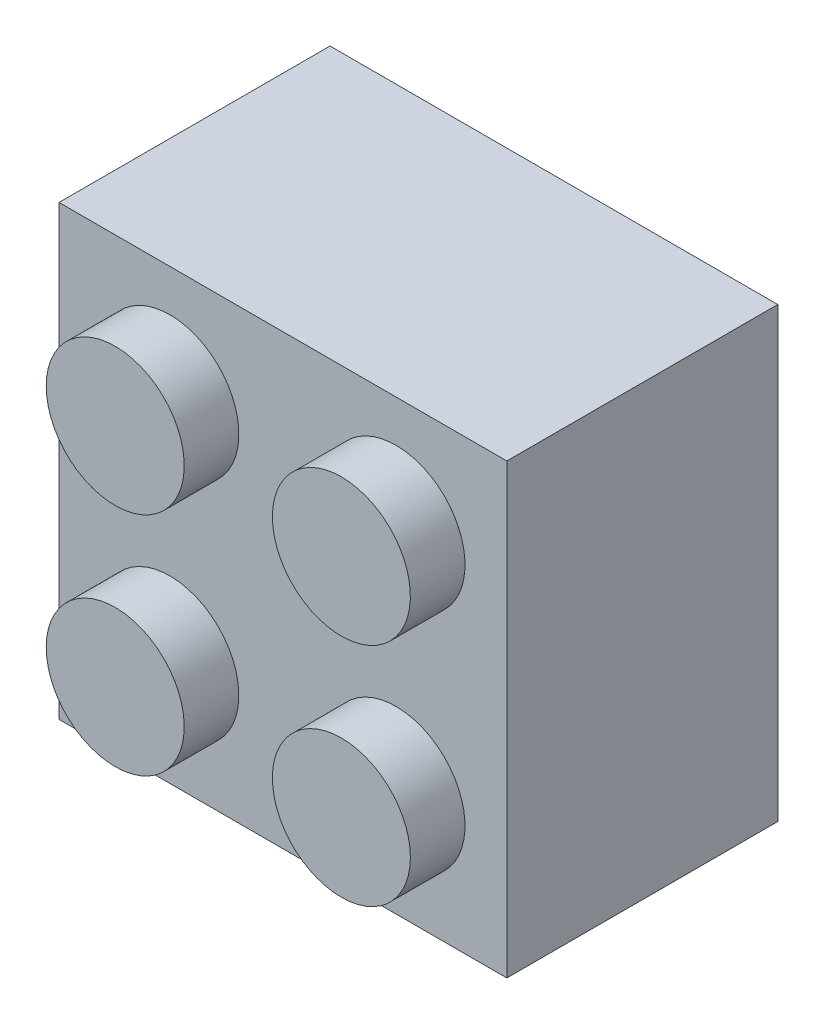
ISO-10303-21;
HEADER;
FILE_DESCRIPTION(('STEP AP214'),'2;1');
FILE_NAME('part.step','',(''),(''),'','','');
FILE_SCHEMA(('AUTOMOTIVE_DESIGN { 1 0 10303 214 1 1 1 1 }'));
ENDSEC;
DATA;
#1=APPLICATION_CONTEXT('core data for automotive mechanical design processes');
#2=APPLICATION_PROTOCOL_DEFINITION('international standard','automotive_design',2000,#1);
#3=PRODUCT_CONTEXT('',#1,'mechanical');
#4=PRODUCT('Part','Part','',(#3));
#5=PRODUCT_RELATED_PRODUCT_CATEGORY('part','',(#4));
#6=PRODUCT_DEFINITION_FORMATION('','',#4);
#7=PRODUCT_DEFINITION_CONTEXT('part definition',#1,'design');
#8=PRODUCT_DEFINITION('design','',#6,#7);
#9=PRODUCT_DEFINITION_SHAPE('','',#8);
#10=(LENGTH_UNIT() NAMED_UNIT(*) SI_UNIT(.MILLI.,.METRE.));
#11=(NAMED_UNIT(*) PLANE_ANGLE_UNIT() SI_UNIT($,.RADIAN.));
#12=(NAMED_UNIT(*) SI_UNIT($,.STERADIAN.) SOLID_ANGLE_UNIT());
#13=UNCERTAINTY_MEASURE_WITH_UNIT(LENGTH_MEASURE(1.E-05),#10,'distance_accuracy_value','');
#14=(GEOMETRIC_REPRESENTATION_CONTEXT(3) GLOBAL_UNCERTAINTY_ASSIGNED_CONTEXT((#13)) GLOBAL_UNIT_ASSIGNED_CONTEXT((#10,
#11,#12)) REPRESENTATION_CONTEXT('',''));
#15=CARTESIAN_POINT('',(0.,0.,0.));
#16=DIRECTION('',(0.,0.,1.));
#17=DIRECTION('',(1.,0.,0.));
#18=AXIS2_PLACEMENT_3D('',#15,#16,#17);
#19=CARTESIAN_POINT('',(7.9121,7.9121,9.5758));
#20=DIRECTION('',(0.,0.,-1.));
#21=DIRECTION('',(-1.,0.,0.));
#22=AXIS2_PLACEMENT_3D('',#19,#20,#21);
#23=PLANE('',#22);
#24=CARTESIAN_POINT('',(-3.99621397387578,3.99621397387577,9.5758));
#25=DIRECTION('',(0.,0.,-1.));
#26=DIRECTION('',(-1.,0.,0.));
#27=AXIS2_PLACEMENT_3D('',#24,#25,#26);
#28=CIRCLE('',#27,2.4384);
#29=CARTESIAN_POINT('',(-6.43461397387578,3.99621397387577,9.5758));
#30=VERTEX_POINT('',#29);
#31=EDGE_CURVE('E47',#30,#30,#28,.F.);
#32=ORIENTED_EDGE('',*,*,#31,.F.);
#33=EDGE_LOOP('',(#32));
#34=FACE_BOUND('',#33,.T.);
#35=CARTESIAN_POINT('',(3.99621397387578,-3.99621397387577,9.5758));
#36=DIRECTION('',(0.,0.,-1.));
#37=DIRECTION('',(-1.,0.,0.));
#38=AXIS2_PLACEMENT_3D('',#35,#36,#37);
#39=CIRCLE('',#38,2.4384);
#40=CARTESIAN_POINT('',(1.55781397387578,-3.99621397387577,9.5758));
#41=VERTEX_POINT('',#40);
#42=EDGE_CURVE('E179',#41,#41,#39,.F.);
#43=ORIENTED_EDGE('',*,*,#42,.F.);
#44=EDGE_LOOP('',(#43));
#45=FACE_BOUND('',#44,.T.);
#46=DIRECTION('',(0.,1.,0.));
#47=VECTOR('',#46,1.);
#48=CARTESIAN_POINT('',(7.9121,-7.9121,9.5758));
#49=LINE('',#48,#47);
#50=CARTESIAN_POINT('',(7.9121,-7.9121,9.5758));
#51=VERTEX_POINT('',#50);
#52=CARTESIAN_POINT('',(7.9121,7.9121,9.5758));
#53=VERTEX_POINT('',#52);
#54=EDGE_CURVE('E157',#51,#53,#49,.T.);
#55=ORIENTED_EDGE('',*,*,#54,.T.);
#56=DIRECTION('',(-1.,0.,0.));
#57=VECTOR('',#56,1.);
#58=CARTESIAN_POINT('',(-7.9121,7.9121,9.5758));
#59=LINE('',#58,#57);
#60=CARTESIAN_POINT('',(-7.9121,7.9121,9.5758));
#61=VERTEX_POINT('',#60);
#62=EDGE_CURVE('E92',#53,#61,#59,.T.);
#63=ORIENTED_EDGE('',*,*,#62,.T.);
#64=DIRECTION('',(0.,-1.,0.));
#65=VECTOR('',#64,1.);
#66=CARTESIAN_POINT('',(-7.9121,-7.9121,9.5758));
#67=LINE('',#66,#65);
#68=CARTESIAN_POINT('',(-7.9121,-7.9121,9.5758));
#69=VERTEX_POINT('',#68);
#70=EDGE_CURVE('E160',#61,#69,#67,.T.);
#71=ORIENTED_EDGE('',*,*,#70,.T.);
#72=DIRECTION('',(1.,0.,0.));
#73=VECTOR('',#72,1.);
#74=CARTESIAN_POINT('',(-7.9121,-7.9121,9.5758));
#75=LINE('',#74,#73);
#76=EDGE_CURVE('E63',#69,#51,#75,.T.);
#77=ORIENTED_EDGE('',*,*,#76,.T.);
#78=EDGE_LOOP('',(#55,#63,#71,#77));
#79=FACE_BOUND('',#78,.T.);
#80=CARTESIAN_POINT('',(-3.99621397387578,-3.99621397387576,9.5758));
#81=DIRECTION('',(0.,0.,-1.));
#82=DIRECTION('',(-1.,0.,0.));
#83=AXIS2_PLACEMENT_3D('',#80,#81,#82);
#84=CIRCLE('',#83,2.4384);
#85=CARTESIAN_POINT('',(-6.43461397387578,-3.99621397387576,9.5758));
#86=VERTEX_POINT('',#85);
#87=EDGE_CURVE('E182',#86,#86,#84,.F.);
#88=ORIENTED_EDGE('',*,*,#87,.F.);
#89=EDGE_LOOP('',(#88));
#90=FACE_BOUND('',#89,.T.);
#91=CARTESIAN_POINT('',(3.99621397387581,3.99621397387574,9.5758));
#92=DIRECTION('',(0.,0.,-1.));
#93=DIRECTION('',(-1.,0.,0.));
#94=AXIS2_PLACEMENT_3D('',#91,#92,#93);
#95=CIRCLE('',#94,2.4384);
#96=CARTESIAN_POINT('',(1.55781397387581,3.99621397387574,9.5758));
#97=VERTEX_POINT('',#96);
#98=EDGE_CURVE('E11',#97,#97,#95,.F.);
#99=ORIENTED_EDGE('',*,*,#98,.F.);
#100=EDGE_LOOP('',(#99));
#101=FACE_BOUND('',#100,.T.);
#102=ADVANCED_FACE('F39',(#34,#45,#79,#90,#101),#23,.F.);
#103=CARTESIAN_POINT('',(7.9121,-7.9121,9.5758));
#104=DIRECTION('',(-1.,0.,0.));
#105=DIRECTION('',(0.,0.,1.));
#106=AXIS2_PLACEMENT_3D('',#103,#104,#105);
#107=PLANE('',#106);
#108=DIRECTION('',(0.,1.,0.));
#109=VECTOR('',#108,1.);
#110=CARTESIAN_POINT('',(7.9121,-7.9121,0.));
#111=LINE('',#110,#109);
#112=CARTESIAN_POINT('',(7.9121,-7.9121,0.));
#113=VERTEX_POINT('',#112);
#114=CARTESIAN_POINT('',(7.9121,7.9121,0.));
#115=VERTEX_POINT('',#114);
#116=EDGE_CURVE('E153',#113,#115,#111,.T.);
#117=ORIENTED_EDGE('',*,*,#116,.T.);
#118=DIRECTION('',(0.,0.,-1.));
#119=VECTOR('',#118,1.);
#120=CARTESIAN_POINT('',(7.9121,7.9121,9.5758));
#121=LINE('',#120,#119);
#122=EDGE_CURVE('E177',#53,#115,#121,.T.);
#123=ORIENTED_EDGE('',*,*,#122,.F.);
#124=ORIENTED_EDGE('',*,*,#54,.F.);
#125=DIRECTION('',(0.,0.,-1.));
#126=VECTOR('',#125,1.);
#127=CARTESIAN_POINT('',(7.9121,-7.9121,9.5758));
#128=LINE('',#127,#126);
#129=EDGE_CURVE('E163',#51,#113,#128,.T.);
#130=ORIENTED_EDGE('',*,*,#129,.T.);
#131=EDGE_LOOP('',(#117,#123,#124,#130));
#132=FACE_BOUND('',#131,.T.);
#133=ADVANCED_FACE('F41',(#132),#107,.F.);
#134=CARTESIAN_POINT('',(-7.9121,7.9121,9.5758));
#135=DIRECTION('',(0.,-1.,0.));
#136=DIRECTION('',(0.,0.,-1.));
#137=AXIS2_PLACEMENT_3D('',#134,#135,#136);
#138=PLANE('',#137);
#139=DIRECTION('',(-1.,0.,0.));
#140=VECTOR('',#139,1.);
#141=CARTESIAN_POINT('',(-7.9121,7.9121,0.));
#142=LINE('',#141,#140);
#143=CARTESIAN_POINT('',(-7.9121,7.9121,0.));
#144=VERTEX_POINT('',#143);
#145=EDGE_CURVE('E166',#115,#144,#142,.T.);
#146=ORIENTED_EDGE('',*,*,#145,.T.);
#147=DIRECTION('',(0.,0.,-1.));
#148=VECTOR('',#147,1.);
#149=CARTESIAN_POINT('',(-7.9121,7.9121,9.5758));
#150=LINE('',#149,#148);
#151=EDGE_CURVE('E174',#61,#144,#150,.T.);
#152=ORIENTED_EDGE('',*,*,#151,.F.);
#153=ORIENTED_EDGE('',*,*,#62,.F.);
#154=ORIENTED_EDGE('',*,*,#122,.T.);
#155=EDGE_LOOP('',(#146,#152,#153,#154));
#156=FACE_BOUND('',#155,.T.);
#157=ADVANCED_FACE('F272',(#156),#138,.F.);
#158=CARTESIAN_POINT('',(-7.9121,-7.9121,9.5758));
#159=DIRECTION('',(1.,0.,0.));
#160=DIRECTION('',(0.,0.,-1.));
#161=AXIS2_PLACEMENT_3D('',#158,#159,#160);
#162=PLANE('',#161);
#163=DIRECTION('',(0.,-1.,0.));
#164=VECTOR('',#163,1.);
#165=CARTESIAN_POINT('',(-7.9121,-7.9121,0.));
#166=LINE('',#165,#164);
#167=CARTESIAN_POINT('',(-7.9121,-7.9121,0.));
#168=VERTEX_POINT('',#167);
#169=EDGE_CURVE('E168',#144,#168,#166,.T.);
#170=ORIENTED_EDGE('',*,*,#169,.T.);
#171=DIRECTION('',(0.,0.,-1.));
#172=VECTOR('',#171,1.);
#173=CARTESIAN_POINT('',(-7.9121,-7.9121,9.5758));
#174=LINE('',#173,#172);
#175=EDGE_CURVE('E172',#69,#168,#174,.T.);
#176=ORIENTED_EDGE('',*,*,#175,.F.);
#177=ORIENTED_EDGE('',*,*,#70,.F.);
#178=ORIENTED_EDGE('',*,*,#151,.T.);
#179=EDGE_LOOP('',(#170,#176,#177,#178));
#180=FACE_BOUND('',#179,.T.);
#181=ADVANCED_FACE('F270',(#180),#162,.F.);
#182=CARTESIAN_POINT('',(-7.9121,-7.9121,9.5758));
#183=DIRECTION('',(0.,1.,0.));
#184=DIRECTION('',(0.,0.,1.));
#185=AXIS2_PLACEMENT_3D('',#182,#183,#184);
#186=PLANE('',#185);
#187=DIRECTION('',(1.,0.,0.));
#188=VECTOR('',#187,1.);
#189=CARTESIAN_POINT('',(-7.9121,-7.9121,0.));
#190=LINE('',#189,#188);
#191=EDGE_CURVE('E84',#168,#113,#190,.T.);
#192=ORIENTED_EDGE('',*,*,#191,.T.);
#193=ORIENTED_EDGE('',*,*,#129,.F.);
#194=ORIENTED_EDGE('',*,*,#76,.F.);
#195=ORIENTED_EDGE('',*,*,#175,.T.);
#196=EDGE_LOOP('',(#192,#193,#194,#195));
#197=FACE_BOUND('',#196,.T.);
#198=ADVANCED_FACE('F266',(#197),#186,.F.);
#199=CARTESIAN_POINT('',(7.9121,7.9121,0.));
#200=DIRECTION('',(0.,0.,-1.));
#201=DIRECTION('',(-1.,0.,0.));
#202=AXIS2_PLACEMENT_3D('',#199,#200,#201);
#203=PLANE('',#202);
#204=DIRECTION('',(0.,-1.,0.));
#205=VECTOR('',#204,1.);
#206=CARTESIAN_POINT('',(6.71829999999999,6.71829999999999,0.));
#207=LINE('',#206,#205);
#208=CARTESIAN_POINT('',(6.71829999999999,6.71829999999999,0.));
#209=VERTEX_POINT('',#208);
#210=CARTESIAN_POINT('',(6.71829999999999,-6.71829999999999,0.));
#211=VERTEX_POINT('',#210);
#212=EDGE_CURVE('E54',#209,#211,#207,.T.);
#213=ORIENTED_EDGE('',*,*,#212,.F.);
#214=DIRECTION('',(1.,0.,0.));
#215=VECTOR('',#214,1.);
#216=CARTESIAN_POINT('',(-6.71829999999999,6.71829999999999,0.));
#217=LINE('',#216,#215);
#218=CARTESIAN_POINT('',(-6.71829999999999,6.71829999999999,0.));
#219=VERTEX_POINT('',#218);
#220=EDGE_CURVE('E134',#219,#209,#217,.T.);
#221=ORIENTED_EDGE('',*,*,#220,.F.);
#222=DIRECTION('',(0.,1.,0.));
#223=VECTOR('',#222,1.);
#224=CARTESIAN_POINT('',(-6.71829999999999,6.71829999999999,0.));
#225=LINE('',#224,#223);
#226=CARTESIAN_POINT('',(-6.71829999999999,-6.71829999999999,0.));
#227=VERTEX_POINT('',#226);
#228=EDGE_CURVE('E137',#227,#219,#225,.T.);
#229=ORIENTED_EDGE('',*,*,#228,.F.);
#230=DIRECTION('',(-1.,0.,0.));
#231=VECTOR('',#230,1.);
#232=CARTESIAN_POINT('',(-6.71829999999999,-6.71829999999999,0.));
#233=LINE('',#232,#231);
#234=EDGE_CURVE('E146',#211,#227,#233,.T.);
#235=ORIENTED_EDGE('',*,*,#234,.F.);
#236=EDGE_LOOP('',(#213,#221,#229,#235));
#237=FACE_BOUND('',#236,.T.);
#238=ORIENTED_EDGE('',*,*,#116,.F.);
#239=ORIENTED_EDGE('',*,*,#191,.F.);
#240=ORIENTED_EDGE('',*,*,#169,.F.);
#241=ORIENTED_EDGE('',*,*,#145,.F.);
#242=EDGE_LOOP('',(#238,#239,#240,#241));
#243=FACE_BOUND('',#242,.T.);
#244=ADVANCED_FACE('F262',(#237,#243),#203,.T.);
#245=CARTESIAN_POINT('',(6.71829999999999,6.71829999999999,8.4328));
#246=DIRECTION('',(1.,0.,0.));
#247=DIRECTION('',(0.,0.,-1.));
#248=AXIS2_PLACEMENT_3D('',#245,#246,#247);
#249=PLANE('',#248);
#250=ORIENTED_EDGE('',*,*,#212,.T.);
#251=DIRECTION('',(0.,0.,-1.));
#252=VECTOR('',#251,1.);
#253=CARTESIAN_POINT('',(6.71829999999999,-6.71829999999999,8.4328));
#254=LINE('',#253,#252);
#255=CARTESIAN_POINT('',(6.71829999999999,-6.71829999999999,8.4328));
#256=VERTEX_POINT('',#255);
#257=EDGE_CURVE('E112',#256,#211,#254,.T.);
#258=ORIENTED_EDGE('',*,*,#257,.F.);
#259=DIRECTION('',(0.,-1.,0.));
#260=VECTOR('',#259,1.);
#261=CARTESIAN_POINT('',(6.71829999999999,6.71829999999999,8.4328));
#262=LINE('',#261,#260);
#263=CARTESIAN_POINT('',(6.71829999999999,6.71829999999999,8.4328));
#264=VERTEX_POINT('',#263);
#265=EDGE_CURVE('E116',#264,#256,#262,.T.);
#266=ORIENTED_EDGE('',*,*,#265,.F.);
#267=DIRECTION('',(0.,0.,-1.));
#268=VECTOR('',#267,1.);
#269=CARTESIAN_POINT('',(6.71829999999999,6.71829999999999,8.4328));
#270=LINE('',#269,#268);
#271=EDGE_CURVE('E151',#264,#209,#270,.T.);
#272=ORIENTED_EDGE('',*,*,#271,.T.);
#273=EDGE_LOOP('',(#250,#258,#266,#272));
#274=FACE_BOUND('',#273,.T.);
#275=ADVANCED_FACE('F114',(#274),#249,.F.);
#276=CARTESIAN_POINT('',(-6.71829999999999,6.71829999999999,8.4328));
#277=DIRECTION('',(0.,1.,0.));
#278=DIRECTION('',(0.,0.,1.));
#279=AXIS2_PLACEMENT_3D('',#276,#277,#278);
#280=PLANE('',#279);
#281=ORIENTED_EDGE('',*,*,#220,.T.);
#282=ORIENTED_EDGE('',*,*,#271,.F.);
#283=DIRECTION('',(1.,0.,0.));
#284=VECTOR('',#283,1.);
#285=CARTESIAN_POINT('',(-6.71829999999999,6.71829999999999,8.4328));
#286=LINE('',#285,#284);
#287=CARTESIAN_POINT('',(-6.71829999999999,6.71829999999999,8.4328));
#288=VERTEX_POINT('',#287);
#289=EDGE_CURVE('E122',#288,#264,#286,.T.);
#290=ORIENTED_EDGE('',*,*,#289,.F.);
#291=DIRECTION('',(0.,0.,-1.));
#292=VECTOR('',#291,1.);
#293=CARTESIAN_POINT('',(-6.71829999999999,6.71829999999999,8.4328));
#294=LINE('',#293,#292);
#295=EDGE_CURVE('E154',#288,#219,#294,.T.);
#296=ORIENTED_EDGE('',*,*,#295,.T.);
#297=EDGE_LOOP('',(#281,#282,#290,#296));
#298=FACE_BOUND('',#297,.T.);
#299=ADVANCED_FACE('F251',(#298),#280,.F.);
#300=CARTESIAN_POINT('',(-6.71829999999999,6.71829999999999,8.4328));
#301=DIRECTION('',(-1.,0.,0.));
#302=DIRECTION('',(0.,0.,1.));
#303=AXIS2_PLACEMENT_3D('',#300,#301,#302);
#304=PLANE('',#303);
#305=ORIENTED_EDGE('',*,*,#228,.T.);
#306=ORIENTED_EDGE('',*,*,#295,.F.);
#307=DIRECTION('',(0.,1.,0.));
#308=VECTOR('',#307,1.);
#309=CARTESIAN_POINT('',(-6.71829999999999,6.71829999999999,8.4328));
#310=LINE('',#309,#308);
#311=CARTESIAN_POINT('',(-6.71829999999999,-6.71829999999999,8.4328));
#312=VERTEX_POINT('',#311);
#313=EDGE_CURVE('E130',#312,#288,#310,.T.);
#314=ORIENTED_EDGE('',*,*,#313,.F.);
#315=DIRECTION('',(0.,0.,-1.));
#316=VECTOR('',#315,1.);
#317=CARTESIAN_POINT('',(-6.71829999999999,-6.71829999999999,8.4328));
#318=LINE('',#317,#316);
#319=EDGE_CURVE('E121',#312,#227,#318,.T.);
#320=ORIENTED_EDGE('',*,*,#319,.T.);
#321=EDGE_LOOP('',(#305,#306,#314,#320));
#322=FACE_BOUND('',#321,.T.);
#323=ADVANCED_FACE('F254',(#322),#304,.F.);
#324=CARTESIAN_POINT('',(-6.71829999999999,-6.71829999999999,8.4328));
#325=DIRECTION('',(0.,-1.,0.));
#326=DIRECTION('',(0.,0.,-1.));
#327=AXIS2_PLACEMENT_3D('',#324,#325,#326);
#328=PLANE('',#327);
#329=ORIENTED_EDGE('',*,*,#234,.T.);
#330=ORIENTED_EDGE('',*,*,#319,.F.);
#331=DIRECTION('',(-1.,0.,0.));
#332=VECTOR('',#331,1.);
#333=CARTESIAN_POINT('',(-6.71829999999999,-6.71829999999999,8.4328));
#334=LINE('',#333,#332);
#335=EDGE_CURVE('E125',#256,#312,#334,.T.);
#336=ORIENTED_EDGE('',*,*,#335,.F.);
#337=ORIENTED_EDGE('',*,*,#257,.T.);
#338=EDGE_LOOP('',(#329,#330,#336,#337));
#339=FACE_BOUND('',#338,.T.);
#340=ADVANCED_FACE('F126',(#339),#328,.F.);
#341=CARTESIAN_POINT('',(6.71829999999999,-6.71829999999999,8.4328));
#342=DIRECTION('',(0.,0.,1.));
#343=DIRECTION('',(1.,0.,0.));
#344=AXIS2_PLACEMENT_3D('',#341,#342,#343);
#345=PLANE('',#344);
#346=CARTESIAN_POINT('',(0.,0.,8.4328));
#347=DIRECTION('',(0.,0.,-1.));
#348=DIRECTION('',(-1.,0.,0.));
#349=AXIS2_PLACEMENT_3D('',#346,#347,#348);
#350=CIRCLE('',#349,3.2131);
#351=CARTESIAN_POINT('',(-3.2131,0.,8.4328));
#352=VERTEX_POINT('',#351);
#353=EDGE_CURVE('E147',#352,#352,#350,.T.);
#354=ORIENTED_EDGE('',*,*,#353,.F.);
#355=EDGE_LOOP('',(#354));
#356=FACE_BOUND('',#355,.T.);
#357=ORIENTED_EDGE('',*,*,#265,.T.);
#358=ORIENTED_EDGE('',*,*,#335,.T.);
#359=ORIENTED_EDGE('',*,*,#313,.T.);
#360=ORIENTED_EDGE('',*,*,#289,.T.);
#361=EDGE_LOOP('',(#357,#358,#359,#360));
#362=FACE_BOUND('',#361,.T.);
#363=ADVANCED_FACE('F132',(#356,#362),#345,.F.);
#364=CARTESIAN_POINT('',(0.,0.,8.4328));
#365=DIRECTION('',(0.,0.,-1.));
#366=DIRECTION('',(-1.,0.,0.));
#367=AXIS2_PLACEMENT_3D('',#364,#365,#366);
#368=CYLINDRICAL_SURFACE('',#367,3.2131);
#369=ORIENTED_EDGE('',*,*,#353,.T.);
#370=EDGE_LOOP('',(#369));
#371=FACE_BOUND('',#370,.T.);
#372=CARTESIAN_POINT('',(0.,0.,0.));
#373=DIRECTION('',(0.,0.,-1.));
#374=DIRECTION('',(-1.,0.,0.));
#375=AXIS2_PLACEMENT_3D('',#372,#373,#374);
#376=CIRCLE('',#375,3.2131);
#377=CARTESIAN_POINT('',(-3.2131,0.,0.));
#378=VERTEX_POINT('',#377);
#379=EDGE_CURVE('E140',#378,#378,#376,.T.);
#380=ORIENTED_EDGE('',*,*,#379,.F.);
#381=EDGE_LOOP('',(#380));
#382=FACE_BOUND('',#381,.T.);
#383=ADVANCED_FACE('F244',(#371,#382),#368,.T.);
#384=CARTESIAN_POINT('',(0.,0.,0.));
#385=DIRECTION('',(0.,0.,-1.));
#386=DIRECTION('',(-1.,0.,0.));
#387=AXIS2_PLACEMENT_3D('',#384,#385,#386);
#388=CIRCLE('',#387,2.4384);
#389=CARTESIAN_POINT('',(-2.4384,0.,0.));
#390=VERTEX_POINT('',#389);
#391=EDGE_CURVE('E423',#390,#390,#388,.T.);
#392=ORIENTED_EDGE('',*,*,#391,.F.);
#393=EDGE_LOOP('',(#392));
#394=FACE_BOUND('',#393,.T.);
#395=ORIENTED_EDGE('',*,*,#379,.T.);
#396=EDGE_LOOP('',(#395));
#397=FACE_BOUND('',#396,.T.);
#398=ADVANCED_FACE('F242',(#394,#397),#203,.T.);
#399=CARTESIAN_POINT('',(6.71829999999999,-6.71829999999999,8.4328));
#400=DIRECTION('',(0.,0.,1.));
#401=DIRECTION('',(1.,0.,0.));
#402=AXIS2_PLACEMENT_3D('',#399,#400,#401);
#403=PLANE('',#402);
#404=CARTESIAN_POINT('',(0.,0.,8.4328));
#405=DIRECTION('',(0.,0.,1.));
#406=DIRECTION('',(1.,0.,0.));
#407=AXIS2_PLACEMENT_3D('',#404,#405,#406);
#408=CIRCLE('',#407,2.4384);
#409=CARTESIAN_POINT('',(2.4384,0.,8.4328));
#410=VERTEX_POINT('',#409);
#411=EDGE_CURVE('E427',#410,#410,#408,.F.);
#412=ORIENTED_EDGE('',*,*,#411,.T.);
#413=EDGE_LOOP('',(#412));
#414=FACE_BOUND('',#413,.T.);
#415=ADVANCED_FACE('F238',(#414),#403,.F.);
#416=CARTESIAN_POINT('',(0.,0.,15.3296367009811));
#417=DIRECTION('',(0.,0.,-1.));
#418=DIRECTION('',(-1.,0.,0.));
#419=AXIS2_PLACEMENT_3D('',#416,#417,#418);
#420=CYLINDRICAL_SURFACE('',#419,2.4384);
#421=ORIENTED_EDGE('',*,*,#391,.T.);
#422=EDGE_LOOP('',(#421));
#423=FACE_BOUND('',#422,.T.);
#424=ORIENTED_EDGE('',*,*,#411,.F.);
#425=EDGE_LOOP('',(#424));
#426=FACE_BOUND('',#425,.T.);
#427=ADVANCED_FACE('F234',(#423,#426),#420,.F.);
#428=CARTESIAN_POINT('',(3.99621397387578,-3.99621397387577,11.5062));
#429=DIRECTION('',(0.,0.,-1.));
#430=DIRECTION('',(-1.,0.,0.));
#431=AXIS2_PLACEMENT_3D('',#428,#429,#430);
#432=CYLINDRICAL_SURFACE('',#431,2.4384);
#433=CARTESIAN_POINT('',(3.99621397387578,-3.99621397387577,11.5062));
#434=DIRECTION('',(0.,0.,1.));
#435=DIRECTION('',(1.,0.,0.));
#436=AXIS2_PLACEMENT_3D('',#433,#434,#435);
#437=CIRCLE('',#436,2.4384);
#438=CARTESIAN_POINT('',(6.43461397387578,-3.99621397387577,11.5062));
#439=VERTEX_POINT('',#438);
#440=EDGE_CURVE('E432',#439,#439,#437,.T.);
#441=ORIENTED_EDGE('',*,*,#440,.F.);
#442=EDGE_LOOP('',(#441));
#443=FACE_BOUND('',#442,.T.);
#444=ORIENTED_EDGE('',*,*,#42,.T.);
#445=EDGE_LOOP('',(#444));
#446=FACE_BOUND('',#445,.T.);
#447=ADVANCED_FACE('F230',(#443,#446),#432,.T.);
#448=CARTESIAN_POINT('',(3.99621397387578,-3.99621397387577,11.5062));
#449=DIRECTION('',(0.,0.,1.));
#450=DIRECTION('',(1.,0.,0.));
#451=AXIS2_PLACEMENT_3D('',#448,#449,#450);
#452=PLANE('',#451);
#453=ORIENTED_EDGE('',*,*,#440,.T.);
#454=EDGE_LOOP('',(#453));
#455=FACE_BOUND('',#454,.T.);
#456=ADVANCED_FACE('F226',(#455),#452,.T.);
#457=CARTESIAN_POINT('',(-3.99621397387578,-3.99621397387576,11.5062));
#458=DIRECTION('',(0.,0.,-1.));
#459=DIRECTION('',(-1.,0.,0.));
#460=AXIS2_PLACEMENT_3D('',#457,#458,#459);
#461=CYLINDRICAL_SURFACE('',#460,2.4384);
#462=CARTESIAN_POINT('',(-3.99621397387578,-3.99621397387576,11.5062));
#463=DIRECTION('',(0.,0.,1.));
#464=DIRECTION('',(0.,-1.,0.));
#465=AXIS2_PLACEMENT_3D('',#462,#463,#464);
#466=CIRCLE('',#465,2.4384);
#467=CARTESIAN_POINT('',(-3.99621397387579,-6.43461397387576,11.5062));
#468=VERTEX_POINT('',#467);
#469=EDGE_CURVE('E437',#468,#468,#466,.T.);
#470=ORIENTED_EDGE('',*,*,#469,.F.);
#471=EDGE_LOOP('',(#470));
#472=FACE_BOUND('',#471,.T.);
#473=ORIENTED_EDGE('',*,*,#87,.T.);
#474=EDGE_LOOP('',(#473));
#475=FACE_BOUND('',#474,.T.);
#476=ADVANCED_FACE('F222',(#472,#475),#461,.T.);
#477=CARTESIAN_POINT('',(-3.99621397387578,-3.99621397387576,11.5062));
#478=DIRECTION('',(0.,0.,1.));
#479=DIRECTION('',(0.,-1.,0.));
#480=AXIS2_PLACEMENT_3D('',#477,#478,#479);
#481=PLANE('',#480);
#482=ORIENTED_EDGE('',*,*,#469,.T.);
#483=EDGE_LOOP('',(#482));
#484=FACE_BOUND('',#483,.T.);
#485=ADVANCED_FACE('F218',(#484),#481,.T.);
#486=CARTESIAN_POINT('',(-3.99621397387578,3.99621397387577,11.5062));
#487=DIRECTION('',(0.,0.,-1.));
#488=DIRECTION('',(-1.,0.,0.));
#489=AXIS2_PLACEMENT_3D('',#486,#487,#488);
#490=CYLINDRICAL_SURFACE('',#489,2.4384);
#491=CARTESIAN_POINT('',(-3.99621397387578,3.99621397387577,11.5062));
#492=DIRECTION('',(0.,0.,1.));
#493=DIRECTION('',(-1.,0.,0.));
#494=AXIS2_PLACEMENT_3D('',#491,#492,#493);
#495=CIRCLE('',#494,2.4384);
#496=CARTESIAN_POINT('',(-6.43461397387578,3.99621397387577,11.5062));
#497=VERTEX_POINT('',#496);
#498=EDGE_CURVE('E440',#497,#497,#495,.T.);
#499=ORIENTED_EDGE('',*,*,#498,.F.);
#500=EDGE_LOOP('',(#499));
#501=FACE_BOUND('',#500,.T.);
#502=ORIENTED_EDGE('',*,*,#31,.T.);
#503=EDGE_LOOP('',(#502));
#504=FACE_BOUND('',#503,.T.);
#505=ADVANCED_FACE('F187',(#501,#504),#490,.T.);
#506=CARTESIAN_POINT('',(-3.99621397387578,3.99621397387577,11.5062));
#507=DIRECTION('',(0.,0.,1.));
#508=DIRECTION('',(-1.,0.,0.));
#509=AXIS2_PLACEMENT_3D('',#506,#507,#508);
#510=PLANE('',#509);
#511=ORIENTED_EDGE('',*,*,#498,.T.);
#512=EDGE_LOOP('',(#511));
#513=FACE_BOUND('',#512,.T.);
#514=ADVANCED_FACE('F203',(#513),#510,.T.);
#515=CARTESIAN_POINT('',(3.99621397387581,3.99621397387574,11.5062));
#516=DIRECTION('',(0.,0.,-1.));
#517=DIRECTION('',(-1.,0.,0.));
#518=AXIS2_PLACEMENT_3D('',#515,#516,#517);
#519=CYLINDRICAL_SURFACE('',#518,2.4384);
#520=CARTESIAN_POINT('',(3.99621397387581,3.99621397387574,11.5062));
#521=DIRECTION('',(0.,0.,1.));
#522=DIRECTION('',(0.,1.,0.));
#523=AXIS2_PLACEMENT_3D('',#520,#521,#522);
#524=CIRCLE('',#523,2.4384);
#525=CARTESIAN_POINT('',(3.99621397387584,6.43461397387574,11.5062));
#526=VERTEX_POINT('',#525);
#527=EDGE_CURVE('E443',#526,#526,#524,.T.);
#528=ORIENTED_EDGE('',*,*,#527,.F.);
#529=EDGE_LOOP('',(#528));
#530=FACE_BOUND('',#529,.T.);
#531=ORIENTED_EDGE('',*,*,#98,.T.);
#532=EDGE_LOOP('',(#531));
#533=FACE_BOUND('',#532,.T.);
#534=ADVANCED_FACE('F200',(#530,#533),#519,.T.);
#535=CARTESIAN_POINT('',(3.99621397387581,3.99621397387574,11.5062));
#536=DIRECTION('',(0.,0.,1.));
#537=DIRECTION('',(0.,1.,0.));
#538=AXIS2_PLACEMENT_3D('',#535,#536,#537);
#539=PLANE('',#538);
#540=ORIENTED_EDGE('',*,*,#527,.T.);
#541=EDGE_LOOP('',(#540));
#542=FACE_BOUND('',#541,.T.);
#543=ADVANCED_FACE('F202',(#542),#539,.T.);
#544=CLOSED_SHELL('',(#102,#133,#157,#181,#198,#244,#275,#299,#323,#340,#363,#383,#398,#415,
#427,#447,#456,#476,#485,#505,#514,#534,#543));
#545=MANIFOLD_SOLID_BREP('B2',#544);
#546=ADVANCED_BREP_SHAPE_REPRESENTATION('',(#18,#545),#14);
#547=SHAPE_DEFINITION_REPRESENTATION(#9,#546);
ENDSEC;
END-ISO-10303-21;
